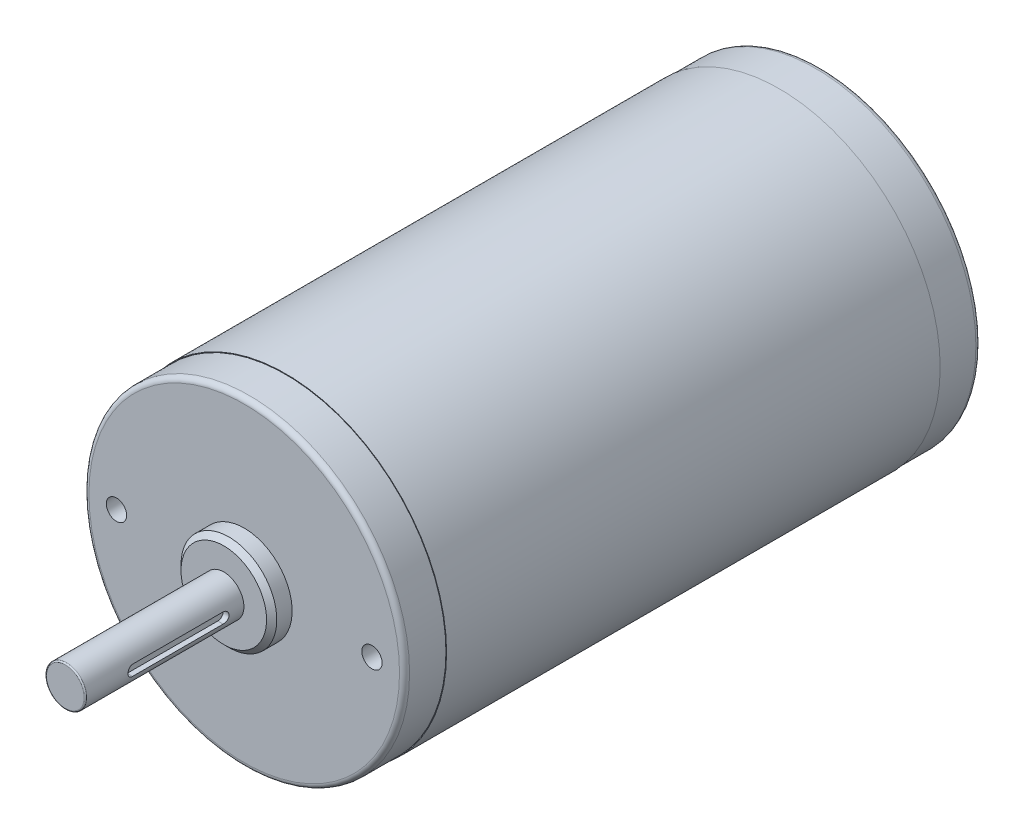
ISO-10303-21;
HEADER;
FILE_DESCRIPTION(('STEP AP214'),'2;1');
FILE_NAME('part.step','',(''),(''),'','','');
FILE_SCHEMA(('AUTOMOTIVE_DESIGN { 1 0 10303 214 1 1 1 1 }'));
ENDSEC;
DATA;
#1=APPLICATION_CONTEXT('core data for automotive mechanical design processes');
#2=APPLICATION_PROTOCOL_DEFINITION('international standard','automotive_design',2000,#1);
#3=PRODUCT_CONTEXT('',#1,'mechanical');
#4=PRODUCT('Part','Part','',(#3));
#5=PRODUCT_RELATED_PRODUCT_CATEGORY('part','',(#4));
#6=PRODUCT_DEFINITION_FORMATION('','',#4);
#7=PRODUCT_DEFINITION_CONTEXT('part definition',#1,'design');
#8=PRODUCT_DEFINITION('design','',#6,#7);
#9=PRODUCT_DEFINITION_SHAPE('','',#8);
#10=(LENGTH_UNIT() NAMED_UNIT(*) SI_UNIT(.MILLI.,.METRE.));
#11=(NAMED_UNIT(*) PLANE_ANGLE_UNIT() SI_UNIT($,.RADIAN.));
#12=(NAMED_UNIT(*) SI_UNIT($,.STERADIAN.) SOLID_ANGLE_UNIT());
#13=UNCERTAINTY_MEASURE_WITH_UNIT(LENGTH_MEASURE(1.E-05),#10,'distance_accuracy_value','');
#14=(GEOMETRIC_REPRESENTATION_CONTEXT(3) GLOBAL_UNCERTAINTY_ASSIGNED_CONTEXT((#13)) GLOBAL_UNIT_ASSIGNED_CONTEXT((#10,
#11,#12)) REPRESENTATION_CONTEXT('',''));
#15=CARTESIAN_POINT('',(0.,0.,0.));
#16=DIRECTION('',(0.,0.,1.));
#17=DIRECTION('',(1.,0.,0.));
#18=AXIS2_PLACEMENT_3D('',#15,#16,#17);
#19=CARTESIAN_POINT('',(35.56,109.2962,54.614));
#20=DIRECTION('',(0.,0.,1.));
#21=DIRECTION('',(1.,0.,0.));
#22=AXIS2_PLACEMENT_3D('',#19,#20,#21);
#23=PLANE('',#22);
#24=CARTESIAN_POINT('',(35.56,109.2962,54.614));
#25=DIRECTION('',(0.,0.,-1.));
#26=DIRECTION('',(-1.,0.,0.));
#27=AXIS2_PLACEMENT_3D('',#24,#25,#26);
#28=CIRCLE('',#27,3.74600000000008);
#29=CARTESIAN_POINT('',(31.8139999999999,109.2962,54.614));
#30=VERTEX_POINT('',#29);
#31=CARTESIAN_POINT('',(39.3060000000001,109.2962,54.614));
#32=VERTEX_POINT('',#31);
#33=EDGE_CURVE('E123',#30,#32,#28,.T.);
#34=ORIENTED_EDGE('',*,*,#33,.F.);
#35=CARTESIAN_POINT('',(35.56,109.2962,54.614));
#36=DIRECTION('',(0.,0.,-1.));
#37=DIRECTION('',(1.,0.,0.));
#38=AXIS2_PLACEMENT_3D('',#35,#36,#37);
#39=CIRCLE('',#38,3.74600000000008);
#40=EDGE_CURVE('E116',#32,#30,#39,.T.);
#41=ORIENTED_EDGE('',*,*,#40,.F.);
#42=EDGE_LOOP('',(#34,#41));
#43=FACE_BOUND('',#42,.T.);
#44=ADVANCED_FACE('F24',(#43),#23,.T.);
#45=CARTESIAN_POINT('',(38.3600000000001,109.2962,16.4984772078548));
#46=DIRECTION('',(1.,0.,0.));
#47=DIRECTION('',(0.,0.,-1.));
#48=AXIS2_PLACEMENT_3D('',#45,#46,#47);
#49=PLANE('',#48);
#50=DIRECTION('',(0.,0.,1.));
#51=VECTOR('',#50,1.);
#52=CARTESIAN_POINT('',(38.3600000000001,108.2462,16.4984772078548));
#53=LINE('',#52,#51);
#54=CARTESIAN_POINT('',(38.3600000000001,108.2462,27.1));
#55=VERTEX_POINT('',#54);
#56=CARTESIAN_POINT('',(38.3600000000001,108.2462,45.1));
#57=VERTEX_POINT('',#56);
#58=EDGE_CURVE('E111',#55,#57,#53,.T.);
#59=ORIENTED_EDGE('',*,*,#58,.F.);
#60=CARTESIAN_POINT('',(38.3600000000001,109.2962,27.1));
#61=DIRECTION('',(1.,0.,0.));
#62=DIRECTION('',(0.,0.,-1.));
#63=AXIS2_PLACEMENT_3D('',#60,#61,#62);
#64=CIRCLE('',#63,1.05);
#65=CARTESIAN_POINT('',(38.3600000000001,110.3462,27.1));
#66=VERTEX_POINT('',#65);
#67=EDGE_CURVE('E101',#55,#66,#64,.T.);
#68=ORIENTED_EDGE('',*,*,#67,.T.);
#69=DIRECTION('',(0.,0.,1.));
#70=VECTOR('',#69,1.);
#71=CARTESIAN_POINT('',(38.3600000000001,110.3462,16.4984772078548));
#72=LINE('',#71,#70);
#73=CARTESIAN_POINT('',(38.3600000000001,110.3462,45.1));
#74=VERTEX_POINT('',#73);
#75=EDGE_CURVE('E127',#66,#74,#72,.T.);
#76=ORIENTED_EDGE('',*,*,#75,.T.);
#77=CARTESIAN_POINT('',(38.3600000000001,109.2962,45.1));
#78=DIRECTION('',(-1.,0.,0.));
#79=DIRECTION('',(0.,0.,1.));
#80=AXIS2_PLACEMENT_3D('',#77,#78,#79);
#81=CIRCLE('',#80,1.05);
#82=EDGE_CURVE('E95',#74,#57,#81,.F.);
#83=ORIENTED_EDGE('',*,*,#82,.T.);
#84=EDGE_LOOP('',(#59,#68,#76,#83));
#85=FACE_BOUND('',#84,.T.);
#86=ADVANCED_FACE('F112',(#85),#49,.T.);
#87=CARTESIAN_POINT('',(38.3600000000001,108.2462,16.4984772078548));
#88=DIRECTION('',(0.,1.,0.));
#89=DIRECTION('',(0.,0.,1.));
#90=AXIS2_PLACEMENT_3D('',#87,#88,#89);
#91=PLANE('',#90);
#92=DIRECTION('',(0.,0.,-1.));
#93=VECTOR('',#92,1.);
#94=CARTESIAN_POINT('',(39.4197279696891,108.2462,54.614));
#95=LINE('',#94,#93);
#96=CARTESIAN_POINT('',(39.4197279696891,108.2462,27.1));
#97=VERTEX_POINT('',#96);
#98=CARTESIAN_POINT('',(39.4197279696891,108.2462,45.1));
#99=VERTEX_POINT('',#98);
#100=EDGE_CURVE('E120',#97,#99,#95,.F.);
#101=ORIENTED_EDGE('',*,*,#100,.F.);
#102=DIRECTION('',(1.,0.,0.));
#103=VECTOR('',#102,1.);
#104=CARTESIAN_POINT('',(38.3600000000001,108.2462,27.1));
#105=LINE('',#104,#103);
#106=EDGE_CURVE('E105',#97,#55,#105,.F.);
#107=ORIENTED_EDGE('',*,*,#106,.T.);
#108=ORIENTED_EDGE('',*,*,#58,.T.);
#109=DIRECTION('',(1.,0.,0.));
#110=VECTOR('',#109,1.);
#111=CARTESIAN_POINT('',(38.3600000000001,108.2462,45.1));
#112=LINE('',#111,#110);
#113=EDGE_CURVE('E121',#57,#99,#112,.T.);
#114=ORIENTED_EDGE('',*,*,#113,.T.);
#115=EDGE_LOOP('',(#101,#107,#108,#114));
#116=FACE_BOUND('',#115,.T.);
#117=ADVANCED_FACE('F118',(#116),#91,.T.);
#118=CARTESIAN_POINT('',(35.56,109.2962,54.36));
#119=DIRECTION('',(0.,0.,1.));
#120=DIRECTION('',(1.,0.,0.));
#121=AXIS2_PLACEMENT_3D('',#118,#119,#120);
#122=TOROIDAL_SURFACE('',#121,3.74600000000008,0.254);
#123=ORIENTED_EDGE('',*,*,#40,.T.);
#124=ORIENTED_EDGE('',*,*,#33,.T.);
#125=EDGE_LOOP('',(#123,#124));
#126=FACE_BOUND('',#125,.T.);
#127=CARTESIAN_POINT('',(35.56,109.2962,54.36));
#128=DIRECTION('',(0.,0.,-1.));
#129=DIRECTION('',(-1.,0.,0.));
#130=AXIS2_PLACEMENT_3D('',#127,#128,#129);
#131=CIRCLE('',#130,4.00000000000007);
#132=CARTESIAN_POINT('',(31.5599999999999,109.2962,54.36));
#133=VERTEX_POINT('',#132);
#134=EDGE_CURVE('E172',#133,#133,#131,.T.);
#135=ORIENTED_EDGE('',*,*,#134,.F.);
#136=EDGE_LOOP('',(#135));
#137=FACE_BOUND('',#136,.T.);
#138=ADVANCED_FACE('F154',(#126,#137),#122,.T.);
#139=CARTESIAN_POINT('',(38.3600000000001,109.2962,45.1));
#140=DIRECTION('',(-1.,0.,0.));
#141=DIRECTION('',(0.,0.,1.));
#142=AXIS2_PLACEMENT_3D('',#139,#140,#141);
#143=CYLINDRICAL_SURFACE('',#142,1.05);
#144=DIRECTION('',(1.,0.,0.));
#145=VECTOR('',#144,1.);
#146=CARTESIAN_POINT('',(38.3600000000001,110.3462,45.1));
#147=LINE('',#146,#145);
#148=CARTESIAN_POINT('',(39.4197279696891,110.3462,45.1));
#149=VERTEX_POINT('',#148);
#150=EDGE_CURVE('E109',#74,#149,#147,.T.);
#151=ORIENTED_EDGE('',*,*,#150,.T.);
#152=CARTESIAN_POINT('',(39.4197279696891,108.2462,45.1));
#153=CARTESIAN_POINT('',(39.4197258950768,108.24619958975,45.1289948990377));
#154=CARTESIAN_POINT('',(39.4200551064328,108.247401772744,45.1579753771942));
#155=CARTESIAN_POINT('',(39.4213547123988,108.252193790165,45.2157185717611));
#156=CARTESIAN_POINT('',(39.4223249908093,108.255783191888,45.2444813266804));
#157=CARTESIAN_POINT('',(39.4261578920524,108.270078067236,45.3300048839447));
#158=CARTESIAN_POINT('',(39.4299428342912,108.284310457697,45.3861763507014));
#159=CARTESIAN_POINT('',(39.4395286889104,108.321713164946,45.4952257963179));
#160=CARTESIAN_POINT('',(39.445329326456,108.344882263286,45.5481042230163));
#161=CARTESIAN_POINT('',(39.4582892232805,108.399469503916,45.6492511443793));
#162=CARTESIAN_POINT('',(39.4654488628844,108.430889956344,45.6975183428654));
#163=CARTESIAN_POINT('',(39.4805119710478,108.501890363002,45.7892077701155));
#164=CARTESIAN_POINT('',(39.4884281885094,108.541632256913,45.8325024671448));
#165=CARTESIAN_POINT('',(39.5040047400555,108.627813145963,45.9119068745175));
#166=CARTESIAN_POINT('',(39.5116649818293,108.67425452566,45.9480140156475));
#167=CARTESIAN_POINT('',(39.526010604883,108.773412379805,46.0125503896214));
#168=CARTESIAN_POINT('',(39.5326785635433,108.826216831296,46.040848518688));
#169=CARTESIAN_POINT('',(39.5441298010583,108.936002054238,46.0880888400132));
#170=CARTESIAN_POINT('',(39.5489153447307,108.992977708579,46.1070422822868));
#171=CARTESIAN_POINT('',(39.5549473168842,109.091228422711,46.1306241727345));
#172=CARTESIAN_POINT('',(39.5568321627736,109.13185376544,46.1378772746766));
#173=CARTESIAN_POINT('',(39.5593590428507,109.213713896391,46.147566034752));
#174=CARTESIAN_POINT('',(39.560001100914,109.254948672889,46.1500017854335));
#175=CARTESIAN_POINT('',(39.5599984549201,109.354094261643,46.1499974942296));
#176=CARTESIAN_POINT('',(39.5587300938834,109.412021122661,46.1451938276971));
#177=CARTESIAN_POINT('',(39.5537908073877,109.526225171743,46.1261319193829));
#178=CARTESIAN_POINT('',(39.5501176251492,109.582500758305,46.1118647965529));
#179=CARTESIAN_POINT('',(39.5407752151886,109.691711041936,46.0743710095572));
#180=CARTESIAN_POINT('',(39.5351088856793,109.744650458997,46.051157349786));
#181=CARTESIAN_POINT('',(39.5223803452478,109.845880148194,45.9964722913931));
#182=CARTESIAN_POINT('',(39.5153181479083,109.894170465564,45.9650009731229));
#183=CARTESIAN_POINT('',(39.5003832391547,109.985824414736,45.8939447079381));
#184=CARTESIAN_POINT('',(39.4924970081334,110.029068444468,45.8542083308329));
#185=CARTESIAN_POINT('',(39.4768899553604,110.108363690847,45.768070017791));
#186=CARTESIAN_POINT('',(39.4691691622905,110.144413669136,45.7216669366335));
#187=CARTESIAN_POINT('',(39.4546281048764,110.208880604601,45.6225587145474));
#188=CARTESIAN_POINT('',(39.447825217303,110.237158627992,45.5697605148942));
#189=CARTESIAN_POINT('',(39.4360941322255,110.284374941225,45.4599645484902));
#190=CARTESIAN_POINT('',(39.4311644713835,110.303320524877,45.4029701015121));
#191=CARTESIAN_POINT('',(39.424947536189,110.326869937927,45.3047298343336));
#192=CARTESIAN_POINT('',(39.4230031721686,110.334106552333,45.2641375466187));
#193=CARTESIAN_POINT('',(39.4203876966156,110.343775049367,45.1823710409093));
#194=CARTESIAN_POINT('',(39.419715789786,110.346209933161,45.141197202614));
#195=CARTESIAN_POINT('',(39.4197279696891,110.3462,45.1));
#196=B_SPLINE_CURVE_WITH_KNOTS('',3,(#152,#153,#154,#155,#156,#157,#158,#159,#160,#161,#162,
#163,#164,#165,#166,#167,#168,#169,#170,#171,#172,#173,#174,#175,#176,#177,#178,#179,#180,#181,
#182,#183,#184,#185,#186,#187,#188,#189,#190,#191,#192,#193,#194,#195),.UNSPECIFIED.,.F.,.F.,(4,
2,2,2,2,2,2,2,2,2,2,2,2,2,2,2,2,2,2,2,2,4),(0.,0.0869295778834422,0.17384340328612,
0.347151826879625,0.520436629596116,0.69376999881019,0.870856390838584,1.04800596970821,
1.22797015523126,1.40771715061754,1.53136439682193,1.65500926755904,1.82853892099362,
2.0022316554156,2.17567286221397,2.34911238140169,2.52606492372393,2.70304789975981,
2.88301467869373,3.0628405797152,3.18638852057382,3.3098592173462),.UNSPECIFIED.);
#197=EDGE_CURVE('E175',#99,#149,#196,.T.);
#198=ORIENTED_EDGE('',*,*,#197,.F.);
#199=ORIENTED_EDGE('',*,*,#113,.F.);
#200=ORIENTED_EDGE('',*,*,#82,.F.);
#201=EDGE_LOOP('',(#151,#198,#199,#200));
#202=FACE_BOUND('',#201,.T.);
#203=ADVANCED_FACE('F164',(#202),#143,.F.);
#204=CARTESIAN_POINT('',(38.3600000000001,110.3462,16.4984772078548));
#205=DIRECTION('',(0.,1.,0.));
#206=DIRECTION('',(0.,0.,1.));
#207=AXIS2_PLACEMENT_3D('',#204,#205,#206);
#208=PLANE('',#207);
#209=ORIENTED_EDGE('',*,*,#150,.F.);
#210=ORIENTED_EDGE('',*,*,#75,.F.);
#211=DIRECTION('',(1.,0.,0.));
#212=VECTOR('',#211,1.);
#213=CARTESIAN_POINT('',(38.3600000000001,110.3462,27.1));
#214=LINE('',#213,#212);
#215=CARTESIAN_POINT('',(39.4197279696891,110.3462,27.1));
#216=VERTEX_POINT('',#215);
#217=EDGE_CURVE('E107',#66,#216,#214,.T.);
#218=ORIENTED_EDGE('',*,*,#217,.T.);
#219=DIRECTION('',(0.,0.,-1.));
#220=VECTOR('',#219,1.);
#221=CARTESIAN_POINT('',(39.4197279696891,110.3462,54.614));
#222=LINE('',#221,#220);
#223=EDGE_CURVE('E177',#149,#216,#222,.T.);
#224=ORIENTED_EDGE('',*,*,#223,.F.);
#225=EDGE_LOOP('',(#209,#210,#218,#224));
#226=FACE_BOUND('',#225,.T.);
#227=ADVANCED_FACE('F423',(#226),#208,.F.);
#228=CARTESIAN_POINT('',(38.3600000000001,109.2962,27.1));
#229=DIRECTION('',(1.,0.,0.));
#230=DIRECTION('',(0.,0.,-1.));
#231=AXIS2_PLACEMENT_3D('',#228,#229,#230);
#232=CYLINDRICAL_SURFACE('',#231,1.05);
#233=ORIENTED_EDGE('',*,*,#67,.F.);
#234=ORIENTED_EDGE('',*,*,#106,.F.);
#235=CARTESIAN_POINT('',(39.4197279696891,110.3462,27.1));
#236=CARTESIAN_POINT('',(39.4197258950768,110.34620041025,27.0710051009623));
#237=CARTESIAN_POINT('',(39.4200551064329,110.344998227256,27.0420246228058));
#238=CARTESIAN_POINT('',(39.4213547123988,110.340206209835,26.9842814282389));
#239=CARTESIAN_POINT('',(39.4223249908093,110.336616808112,26.9555186733196));
#240=CARTESIAN_POINT('',(39.4261578920524,110.322321932764,26.8699951160553));
#241=CARTESIAN_POINT('',(39.4299428342912,110.308089542303,26.8138236492985));
#242=CARTESIAN_POINT('',(39.4395286889104,110.270686835054,26.7047742036821));
#243=CARTESIAN_POINT('',(39.445329326456,110.247517736714,26.6518957769836));
#244=CARTESIAN_POINT('',(39.4582892232805,110.192930496084,26.5507488556207));
#245=CARTESIAN_POINT('',(39.4654488628844,110.161510043656,26.5024816571346));
#246=CARTESIAN_POINT('',(39.4805119710478,110.090509636998,26.4107922298844));
#247=CARTESIAN_POINT('',(39.4884281885094,110.050767743087,26.3674975328551));
#248=CARTESIAN_POINT('',(39.5040047400555,109.964586854037,26.2880931254825));
#249=CARTESIAN_POINT('',(39.5116649818293,109.91814547434,26.2519859843525));
#250=CARTESIAN_POINT('',(39.526010604883,109.818987620195,26.1874496103786));
#251=CARTESIAN_POINT('',(39.5326785635433,109.766183168704,26.159151481312));
#252=CARTESIAN_POINT('',(39.5441298010583,109.656397945762,26.1119111599868));
#253=CARTESIAN_POINT('',(39.5489153447307,109.599422291421,26.0929577177131));
#254=CARTESIAN_POINT('',(39.5549473168842,109.501171577289,26.0693758272655));
#255=CARTESIAN_POINT('',(39.5568321627736,109.46054623456,26.0621227253234));
#256=CARTESIAN_POINT('',(39.5593590428507,109.378686103609,26.052433965248));
#257=CARTESIAN_POINT('',(39.560001100914,109.337451327111,26.0499982145665));
#258=CARTESIAN_POINT('',(39.5599984549201,109.238305738357,26.0500025057704));
#259=CARTESIAN_POINT('',(39.5587300938834,109.18037887734,26.0548061723029));
#260=CARTESIAN_POINT('',(39.5537908073877,109.066174828257,26.0738680806171));
#261=CARTESIAN_POINT('',(39.5501176251492,109.009899241695,26.0881352034471));
#262=CARTESIAN_POINT('',(39.5407752151886,108.900688958064,26.1256289904428));
#263=CARTESIAN_POINT('',(39.5351088856793,108.847749541003,26.148842650214));
#264=CARTESIAN_POINT('',(39.5223803452478,108.746519851806,26.2035277086069));
#265=CARTESIAN_POINT('',(39.5153181479083,108.698229534436,26.2349990268771));
#266=CARTESIAN_POINT('',(39.5003832391547,108.606575585264,26.3060552920619));
#267=CARTESIAN_POINT('',(39.4924970081334,108.563331555532,26.3457916691671));
#268=CARTESIAN_POINT('',(39.4768899553604,108.484036309153,26.431929982209));
#269=CARTESIAN_POINT('',(39.4691691622905,108.447986330864,26.4783330633665));
#270=CARTESIAN_POINT('',(39.4546281048764,108.383519395399,26.5774412854526));
#271=CARTESIAN_POINT('',(39.447825217303,108.355241372008,26.6302394851058));
#272=CARTESIAN_POINT('',(39.4360941322255,108.308025058775,26.7400354515098));
#273=CARTESIAN_POINT('',(39.4311644713835,108.289079475123,26.7970298984879));
#274=CARTESIAN_POINT('',(39.424947536189,108.265530062073,26.8952701656664));
#275=CARTESIAN_POINT('',(39.4230031721686,108.258293447667,26.9358624533813));
#276=CARTESIAN_POINT('',(39.4203876966156,108.248624950633,27.0176289590907));
#277=CARTESIAN_POINT('',(39.419715789786,108.246190066839,27.058802797386));
#278=CARTESIAN_POINT('',(39.4197279696891,108.2462,27.1));
#279=B_SPLINE_CURVE_WITH_KNOTS('',3,(#235,#236,#237,#238,#239,#240,#241,#242,#243,#244,#245,
#246,#247,#248,#249,#250,#251,#252,#253,#254,#255,#256,#257,#258,#259,#260,#261,#262,#263,#264,
#265,#266,#267,#268,#269,#270,#271,#272,#273,#274,#275,#276,#277,#278),.UNSPECIFIED.,.F.,.F.,(4,
2,2,2,2,2,2,2,2,2,2,2,2,2,2,2,2,2,2,2,2,4),(0.,0.0869295778834455,0.173843403286115,
0.347151826879623,0.520436629596136,0.693769998810197,0.870856390838592,1.0480059697082,
1.22797015523124,1.40771715061754,1.53136439682191,1.65500926755904,1.82853892099358,
2.00223165541559,2.17567286221396,2.34911238140168,2.52606492372391,2.7030478997598,
2.88301467869372,3.06284057971519,3.18638852057381,3.30985921734618),.UNSPECIFIED.);
#280=EDGE_CURVE('E180',#216,#97,#279,.T.);
#281=ORIENTED_EDGE('',*,*,#280,.F.);
#282=ORIENTED_EDGE('',*,*,#217,.F.);
#283=EDGE_LOOP('',(#233,#234,#281,#282));
#284=FACE_BOUND('',#283,.T.);
#285=ADVANCED_FACE('F102',(#284),#232,.F.);
#286=CARTESIAN_POINT('',(35.56,109.2962,54.614));
#287=DIRECTION('',(0.,0.,-1.));
#288=DIRECTION('',(-1.,0.,0.));
#289=AXIS2_PLACEMENT_3D('',#286,#287,#288);
#290=CYLINDRICAL_SURFACE('',#289,4.00000000000007);
#291=ORIENTED_EDGE('',*,*,#100,.T.);
#292=ORIENTED_EDGE('',*,*,#197,.T.);
#293=ORIENTED_EDGE('',*,*,#223,.T.);
#294=ORIENTED_EDGE('',*,*,#280,.T.);
#295=EDGE_LOOP('',(#291,#292,#293,#294));
#296=FACE_BOUND('',#295,.T.);
#297=CARTESIAN_POINT('',(35.56,109.2962,23.114));
#298=DIRECTION('',(0.,0.,-1.));
#299=DIRECTION('',(-1.,0.,0.));
#300=AXIS2_PLACEMENT_3D('',#297,#298,#299);
#301=CIRCLE('',#300,4.00000000000007);
#302=CARTESIAN_POINT('',(31.5599999999999,109.2962,23.114));
#303=VERTEX_POINT('',#302);
#304=EDGE_CURVE('E416',#303,#303,#301,.T.);
#305=ORIENTED_EDGE('',*,*,#304,.F.);
#306=EDGE_LOOP('',(#305));
#307=FACE_BOUND('',#306,.T.);
#308=ORIENTED_EDGE('',*,*,#134,.T.);
#309=EDGE_LOOP('',(#308));
#310=FACE_BOUND('',#309,.T.);
#311=ADVANCED_FACE('F263',(#296,#307,#310),#290,.T.);
#312=CARTESIAN_POINT('',(35.56,109.2962,23.114));
#313=DIRECTION('',(0.,0.,1.));
#314=DIRECTION('',(1.,0.,0.));
#315=AXIS2_PLACEMENT_3D('',#312,#313,#314);
#316=PLANE('',#315);
#317=ORIENTED_EDGE('',*,*,#304,.T.);
#318=EDGE_LOOP('',(#317));
#319=FACE_BOUND('',#318,.T.);
#320=CARTESIAN_POINT('',(35.56,109.2962,23.114));
#321=DIRECTION('',(0.,0.,-1.));
#322=DIRECTION('',(-1.,0.,0.));
#323=AXIS2_PLACEMENT_3D('',#320,#321,#322);
#324=CIRCLE('',#323,8.50900000182337);
#325=CARTESIAN_POINT('',(27.0509999981766,109.2962,23.114));
#326=VERTEX_POINT('',#325);
#327=EDGE_CURVE('E414',#326,#326,#324,.T.);
#328=ORIENTED_EDGE('',*,*,#327,.F.);
#329=EDGE_LOOP('',(#328));
#330=FACE_BOUND('',#329,.T.);
#331=ADVANCED_FACE('F259',(#319,#330),#316,.T.);
#332=CARTESIAN_POINT('',(48.8853596371201,127.903290682857,-97.8026999980236));
#333=DIRECTION('',(0.,0.,-1.));
#334=DIRECTION('',(-1.,0.,0.));
#335=AXIS2_PLACEMENT_3D('',#332,#333,#334);
#336=PLANE('',#335);
#337=CARTESIAN_POINT('',(46.76735963712,127.903290682857,-97.8026999979988));
#338=DIRECTION('',(0.,0.,1.));
#339=DIRECTION('',(0.,-1.,0.));
#340=AXIS2_PLACEMENT_3D('',#337,#338,#339);
#341=CIRCLE('',#340,2.11800000003411);
#342=CARTESIAN_POINT('',(46.76735963712,125.785290682823,-97.8026999979988));
#343=VERTEX_POINT('',#342);
#344=EDGE_CURVE('E411',#343,#343,#341,.T.);
#345=ORIENTED_EDGE('',*,*,#344,.F.);
#346=EDGE_LOOP('',(#345));
#347=FACE_BOUND('',#346,.T.);
#348=ADVANCED_FACE('F255',(#347),#336,.T.);
#349=CARTESIAN_POINT('',(56.2850906808811,120.503559639096,-97.8026999980238));
#350=DIRECTION('',(0.,0.,-1.));
#351=DIRECTION('',(-1.,0.,0.));
#352=AXIS2_PLACEMENT_3D('',#349,#350,#351);
#353=PLANE('',#352);
#354=CARTESIAN_POINT('',(54.1670906808811,120.503559639096,-97.8026999980557));
#355=DIRECTION('',(0.,0.,1.));
#356=DIRECTION('',(0.,-1.,0.));
#357=AXIS2_PLACEMENT_3D('',#354,#355,#356);
#358=CIRCLE('',#357,2.11799999994966);
#359=CARTESIAN_POINT('',(54.1670906808811,118.385559639146,-97.8026999980557));
#360=VERTEX_POINT('',#359);
#361=EDGE_CURVE('E407',#360,#360,#358,.T.);
#362=ORIENTED_EDGE('',*,*,#361,.F.);
#363=EDGE_LOOP('',(#362));
#364=FACE_BOUND('',#363,.T.);
#365=ADVANCED_FACE('F243',(#364),#353,.T.);
#366=CARTESIAN_POINT('',(35.56,109.2962,-100.317299999998));
#367=DIRECTION('',(0.,0.,-1.));
#368=DIRECTION('',(-1.,0.,0.));
#369=AXIS2_PLACEMENT_3D('',#366,#367,#368);
#370=PLANE('',#369);
#371=CARTESIAN_POINT('',(35.56,109.2962,-100.317299999998));
#372=DIRECTION('',(0.,0.,1.));
#373=DIRECTION('',(1.,0.,0.));
#374=AXIS2_PLACEMENT_3D('',#371,#372,#373);
#375=CIRCLE('',#374,14.0368000000003);
#376=CARTESIAN_POINT('',(49.5968000000003,109.2962,-100.317299999998));
#377=VERTEX_POINT('',#376);
#378=CARTESIAN_POINT('',(21.5231999999997,109.2962,-100.317299999998));
#379=VERTEX_POINT('',#378);
#380=EDGE_CURVE('E224',#377,#379,#375,.T.);
#381=ORIENTED_EDGE('',*,*,#380,.F.);
#382=CARTESIAN_POINT('',(35.56,109.2962,-100.317299999998));
#383=DIRECTION('',(0.,0.,1.));
#384=DIRECTION('',(-1.,0.,0.));
#385=AXIS2_PLACEMENT_3D('',#382,#383,#384);
#386=CIRCLE('',#385,14.0368000000003);
#387=EDGE_CURVE('E410',#379,#377,#386,.T.);
#388=ORIENTED_EDGE('',*,*,#387,.F.);
#389=EDGE_LOOP('',(#381,#388));
#390=FACE_BOUND('',#389,.T.);
#391=ADVANCED_FACE('F232',(#390),#370,.T.);
#392=CARTESIAN_POINT('',(10.1599999999994,109.2962,5.43560000011212));
#393=DIRECTION('',(0.,0.,1.));
#394=DIRECTION('',(1.,0.,0.));
#395=AXIS2_PLACEMENT_3D('',#392,#393,#394);
#396=CONICAL_SURFACE('',#395,2.01930000012817,1.02974425747654);
#397=CARTESIAN_POINT('',(10.1600000000133,109.2962,4.22228214875986));
#398=VERTEX_POINT('',#397);
#399=VERTEX_LOOP('',#398);
#400=FACE_BOUND('',#399,.T.);
#401=CARTESIAN_POINT('',(10.1599999999994,109.2962,5.4356000000007));
#402=DIRECTION('',(0.,0.,1.));
#403=DIRECTION('',(1.,0.,0.));
#404=AXIS2_PLACEMENT_3D('',#401,#402,#403);
#405=CIRCLE('',#404,2.01930000000003);
#406=CARTESIAN_POINT('',(12.1792999999994,109.2962,5.4356000000007));
#407=VERTEX_POINT('',#406);
#408=EDGE_CURVE('E221',#407,#407,#405,.T.);
#409=ORIENTED_EDGE('',*,*,#408,.T.);
#410=EDGE_LOOP('',(#409));
#411=FACE_BOUND('',#410,.T.);
#412=ADVANCED_FACE('F242',(#400,#411),#396,.F.);
#413=CARTESIAN_POINT('',(60.96,109.2962,5.43559999994159));
#414=DIRECTION('',(0.,0.,1.));
#415=DIRECTION('',(1.,0.,0.));
#416=AXIS2_PLACEMENT_3D('',#413,#414,#415);
#417=CONICAL_SURFACE('',#416,2.01929999988128,1.02974425744088);
#418=CARTESIAN_POINT('',(60.9599999998807,109.2962,4.22228214875986));
#419=VERTEX_POINT('',#418);
#420=VERTEX_LOOP('',#419);
#421=FACE_BOUND('',#420,.T.);
#422=CARTESIAN_POINT('',(60.96,109.2962,5.43560000000074));
#423=DIRECTION('',(0.,0.,1.));
#424=DIRECTION('',(1.,0.,0.));
#425=AXIS2_PLACEMENT_3D('',#422,#423,#424);
#426=CIRCLE('',#425,2.01930000000003);
#427=CARTESIAN_POINT('',(62.9793,109.2962,5.43560000000074));
#428=VERTEX_POINT('',#427);
#429=EDGE_CURVE('E218',#428,#428,#426,.T.);
#430=ORIENTED_EDGE('',*,*,#429,.T.);
#431=EDGE_LOOP('',(#430));
#432=FACE_BOUND('',#431,.T.);
#433=ADVANCED_FACE('F627',(#421,#432),#417,.F.);
#434=CARTESIAN_POINT('',(35.56,109.2962,22.0979999999996));
#435=DIRECTION('',(0.,0.,-1.));
#436=DIRECTION('',(-1.,0.,0.));
#437=AXIS2_PLACEMENT_3D('',#434,#435,#436);
#438=CONICAL_SURFACE('',#437,9.52500000000019,0.785398162500005);
#439=CARTESIAN_POINT('',(35.56,109.2962,22.0979999999996));
#440=DIRECTION('',(0.,0.,-1.));
#441=DIRECTION('',(-1.,0.,0.));
#442=AXIS2_PLACEMENT_3D('',#439,#440,#441);
#443=CIRCLE('',#442,9.52500000000019);
#444=CARTESIAN_POINT('',(26.0349999999998,109.2962,22.0979999999996));
#445=VERTEX_POINT('',#444);
#446=EDGE_CURVE('E215',#445,#445,#443,.T.);
#447=ORIENTED_EDGE('',*,*,#446,.F.);
#448=EDGE_LOOP('',(#447));
#449=FACE_BOUND('',#448,.T.);
#450=ORIENTED_EDGE('',*,*,#327,.T.);
#451=EDGE_LOOP('',(#450));
#452=FACE_BOUND('',#451,.T.);
#453=ADVANCED_FACE('F618',(#449,#452),#438,.T.);
#454=CARTESIAN_POINT('',(46.76735963712,127.903290682857,-95.6026999959931));
#455=DIRECTION('',(0.,0.,1.));
#456=DIRECTION('',(0.,-1.,0.));
#457=AXIS2_PLACEMENT_3D('',#454,#455,#456);
#458=CONICAL_SURFACE('',#457,4.31800000198298,0.785398163384529);
#459=CARTESIAN_POINT('',(46.76735963712,127.903290682857,-95.6026999960491));
#460=DIRECTION('',(0.,0.,1.));
#461=DIRECTION('',(1.,0.,0.));
#462=AXIS2_PLACEMENT_3D('',#459,#460,#461);
#463=CIRCLE('',#462,4.3180000019745);
#464=CARTESIAN_POINT('',(51.0853596390945,127.903290682857,-95.6026999960491));
#465=VERTEX_POINT('',#464);
#466=EDGE_CURVE('E212',#465,#465,#463,.T.);
#467=ORIENTED_EDGE('',*,*,#466,.F.);
#468=EDGE_LOOP('',(#467));
#469=FACE_BOUND('',#468,.T.);
#470=ORIENTED_EDGE('',*,*,#344,.T.);
#471=EDGE_LOOP('',(#470));
#472=FACE_BOUND('',#471,.T.);
#473=ADVANCED_FACE('F609',(#469,#472),#458,.T.);
#474=CARTESIAN_POINT('',(54.1670906808811,120.503559639096,-95.6026999961637));
#475=DIRECTION('',(0.,0.,1.));
#476=DIRECTION('',(0.,-1.,0.));
#477=AXIS2_PLACEMENT_3D('',#474,#475,#476);
#478=CONICAL_SURFACE('',#477,4.31800000184168,0.785398163397448);
#479=CARTESIAN_POINT('',(54.1670906808811,120.503559639096,-95.6026999960494));
#480=DIRECTION('',(0.,0.,1.));
#481=DIRECTION('',(1.,0.,0.));
#482=AXIS2_PLACEMENT_3D('',#479,#480,#481);
#483=CIRCLE('',#482,4.31800000197446);
#484=CARTESIAN_POINT('',(58.4850906828556,120.503559639096,-95.6026999960494));
#485=VERTEX_POINT('',#484);
#486=EDGE_CURVE('E209',#485,#485,#483,.T.);
#487=ORIENTED_EDGE('',*,*,#486,.F.);
#488=EDGE_LOOP('',(#487));
#489=FACE_BOUND('',#488,.T.);
#490=ORIENTED_EDGE('',*,*,#361,.T.);
#491=EDGE_LOOP('',(#490));
#492=FACE_BOUND('',#491,.T.);
#493=ADVANCED_FACE('F199',(#489,#492),#478,.T.);
#494=CARTESIAN_POINT('',(35.56,109.2962,-99.317299999998));
#495=DIRECTION('',(0.,0.,-1.));
#496=DIRECTION('',(-1.,0.,0.));
#497=AXIS2_PLACEMENT_3D('',#494,#495,#496);
#498=TOROIDAL_SURFACE('',#497,14.0368000000003,1.);
#499=ORIENTED_EDGE('',*,*,#387,.T.);
#500=ORIENTED_EDGE('',*,*,#380,.T.);
#501=EDGE_LOOP('',(#499,#500));
#502=FACE_BOUND('',#501,.T.);
#503=CARTESIAN_POINT('',(35.56,109.2962,-99.317299999998));
#504=DIRECTION('',(0.,0.,1.));
#505=DIRECTION('',(1.,0.,0.));
#506=AXIS2_PLACEMENT_3D('',#503,#504,#505);
#507=CIRCLE('',#506,15.0368000000003);
#508=CARTESIAN_POINT('',(50.5968000000003,109.2962,-99.317299999998));
#509=VERTEX_POINT('',#508);
#510=EDGE_CURVE('E207',#509,#509,#507,.T.);
#511=ORIENTED_EDGE('',*,*,#510,.F.);
#512=EDGE_LOOP('',(#511));
#513=FACE_BOUND('',#512,.T.);
#514=ADVANCED_FACE('F187',(#502,#513),#498,.T.);
#515=CARTESIAN_POINT('',(10.1599999999994,109.2962,19.05));
#516=DIRECTION('',(0.,0.,1.));
#517=DIRECTION('',(1.,0.,0.));
#518=AXIS2_PLACEMENT_3D('',#515,#516,#517);
#519=CYLINDRICAL_SURFACE('',#518,2.01930000000003);
#520=CARTESIAN_POINT('',(10.1599999999994,109.2962,19.05));
#521=DIRECTION('',(0.,0.,1.));
#522=DIRECTION('',(1.,0.,0.));
#523=AXIS2_PLACEMENT_3D('',#520,#521,#522);
#524=CIRCLE('',#523,2.01930000000003);
#525=CARTESIAN_POINT('',(12.1792999999994,109.2962,19.05));
#526=VERTEX_POINT('',#525);
#527=EDGE_CURVE('E404',#526,#526,#524,.F.);
#528=ORIENTED_EDGE('',*,*,#527,.F.);
#529=EDGE_LOOP('',(#528));
#530=FACE_BOUND('',#529,.T.);
#531=ORIENTED_EDGE('',*,*,#408,.F.);
#532=EDGE_LOOP('',(#531));
#533=FACE_BOUND('',#532,.T.);
#534=ADVANCED_FACE('F198',(#530,#533),#519,.F.);
#535=CARTESIAN_POINT('',(60.96,109.2962,19.05));
#536=DIRECTION('',(0.,0.,1.));
#537=DIRECTION('',(1.,0.,0.));
#538=AXIS2_PLACEMENT_3D('',#535,#536,#537);
#539=CYLINDRICAL_SURFACE('',#538,2.01930000000003);
#540=CARTESIAN_POINT('',(60.96,109.2962,19.05));
#541=DIRECTION('',(0.,0.,1.));
#542=DIRECTION('',(1.,0.,0.));
#543=AXIS2_PLACEMENT_3D('',#540,#541,#542);
#544=CIRCLE('',#543,2.01930000000003);
#545=CARTESIAN_POINT('',(62.9793,109.2962,19.05));
#546=VERTEX_POINT('',#545);
#547=EDGE_CURVE('E401',#546,#546,#544,.F.);
#548=ORIENTED_EDGE('',*,*,#547,.F.);
#549=EDGE_LOOP('',(#548));
#550=FACE_BOUND('',#549,.T.);
#551=ORIENTED_EDGE('',*,*,#429,.F.);
#552=EDGE_LOOP('',(#551));
#553=FACE_BOUND('',#552,.T.);
#554=ADVANCED_FACE('F578',(#550,#553),#539,.F.);
#555=CARTESIAN_POINT('',(35.56,109.2962,23.114));
#556=DIRECTION('',(0.,0.,-1.));
#557=DIRECTION('',(-1.,0.,0.));
#558=AXIS2_PLACEMENT_3D('',#555,#556,#557);
#559=CYLINDRICAL_SURFACE('',#558,9.52500000000019);
#560=CARTESIAN_POINT('',(35.56,109.2962,19.05));
#561=DIRECTION('',(0.,0.,-1.));
#562=DIRECTION('',(-1.,0.,0.));
#563=AXIS2_PLACEMENT_3D('',#560,#561,#562);
#564=CIRCLE('',#563,9.52500000000019);
#565=CARTESIAN_POINT('',(26.0349999999998,109.2962,19.05));
#566=VERTEX_POINT('',#565);
#567=EDGE_CURVE('E398',#566,#566,#564,.T.);
#568=ORIENTED_EDGE('',*,*,#567,.F.);
#569=EDGE_LOOP('',(#568));
#570=FACE_BOUND('',#569,.T.);
#571=ORIENTED_EDGE('',*,*,#446,.T.);
#572=EDGE_LOOP('',(#571));
#573=FACE_BOUND('',#572,.T.);
#574=ADVANCED_FACE('F569',(#570,#573),#559,.T.);
#575=CARTESIAN_POINT('',(46.76735963712,127.903290682857,-97.8026999980236));
#576=DIRECTION('',(0.,0.,1.));
#577=DIRECTION('',(1.,0.,0.));
#578=AXIS2_PLACEMENT_3D('',#575,#576,#577);
#579=CYLINDRICAL_SURFACE('',#578,4.3180000019745);
#580=CARTESIAN_POINT('',(46.76735963712,127.903290682857,-95.554799999998));
#581=DIRECTION('',(0.,0.,1.));
#582=DIRECTION('',(1.,0.,0.));
#583=AXIS2_PLACEMENT_3D('',#580,#581,#582);
#584=CIRCLE('',#583,4.3180000019745);
#585=CARTESIAN_POINT('',(51.0853596390945,127.903290682857,-95.554799999998));
#586=VERTEX_POINT('',#585);
#587=EDGE_CURVE('E390',#586,#586,#584,.T.);
#588=ORIENTED_EDGE('',*,*,#587,.F.);
#589=EDGE_LOOP('',(#588));
#590=FACE_BOUND('',#589,.T.);
#591=ORIENTED_EDGE('',*,*,#466,.T.);
#592=EDGE_LOOP('',(#591));
#593=FACE_BOUND('',#592,.T.);
#594=ADVANCED_FACE('F560',(#590,#593),#579,.T.);
#595=CARTESIAN_POINT('',(54.1670906808811,120.503559639096,-97.8026999980238));
#596=DIRECTION('',(0.,0.,1.));
#597=DIRECTION('',(1.,0.,0.));
#598=AXIS2_PLACEMENT_3D('',#595,#596,#597);
#599=CYLINDRICAL_SURFACE('',#598,4.31800000197446);
#600=CARTESIAN_POINT('',(54.1670906808811,120.503559639096,-95.554799999998));
#601=DIRECTION('',(0.,0.,1.));
#602=DIRECTION('',(1.,0.,0.));
#603=AXIS2_PLACEMENT_3D('',#600,#601,#602);
#604=CIRCLE('',#603,4.31800000197446);
#605=CARTESIAN_POINT('',(58.4850906828556,120.503559639096,-95.554799999998));
#606=VERTEX_POINT('',#605);
#607=EDGE_CURVE('E386',#606,#606,#604,.T.);
#608=ORIENTED_EDGE('',*,*,#607,.F.);
#609=EDGE_LOOP('',(#608));
#610=FACE_BOUND('',#609,.T.);
#611=ORIENTED_EDGE('',*,*,#486,.T.);
#612=EDGE_LOOP('',(#611));
#613=FACE_BOUND('',#612,.T.);
#614=ADVANCED_FACE('F550',(#610,#613),#599,.T.);
#615=CARTESIAN_POINT('',(35.56,109.2962,-100.317299999998));
#616=DIRECTION('',(0.,0.,1.));
#617=DIRECTION('',(1.,0.,0.));
#618=AXIS2_PLACEMENT_3D('',#615,#616,#617);
#619=CYLINDRICAL_SURFACE('',#618,15.0368000000003);
#620=CARTESIAN_POINT('',(35.56,109.2962,-95.554799999998));
#621=DIRECTION('',(0.,0.,1.));
#622=DIRECTION('',(1.,0.,0.));
#623=AXIS2_PLACEMENT_3D('',#620,#621,#622);
#624=CIRCLE('',#623,15.0368000000003);
#625=CARTESIAN_POINT('',(50.5968000000003,109.2962,-95.554799999998));
#626=VERTEX_POINT('',#625);
#627=EDGE_CURVE('E384',#626,#626,#624,.T.);
#628=ORIENTED_EDGE('',*,*,#627,.F.);
#629=EDGE_LOOP('',(#628));
#630=FACE_BOUND('',#629,.T.);
#631=ORIENTED_EDGE('',*,*,#510,.T.);
#632=EDGE_LOOP('',(#631));
#633=FACE_BOUND('',#632,.T.);
#634=ADVANCED_FACE('F541',(#630,#633),#619,.T.);
#635=CARTESIAN_POINT('',(35.56,109.2962,19.05));
#636=DIRECTION('',(0.,0.,1.));
#637=DIRECTION('',(1.,0.,0.));
#638=AXIS2_PLACEMENT_3D('',#635,#636,#637);
#639=PLANE('',#638);
#640=ORIENTED_EDGE('',*,*,#567,.T.);
#641=EDGE_LOOP('',(#640));
#642=FACE_BOUND('',#641,.T.);
#643=ORIENTED_EDGE('',*,*,#547,.T.);
#644=EDGE_LOOP('',(#643));
#645=FACE_BOUND('',#644,.T.);
#646=ORIENTED_EDGE('',*,*,#527,.T.);
#647=EDGE_LOOP('',(#646));
#648=FACE_BOUND('',#647,.T.);
#649=CARTESIAN_POINT('',(35.56,109.2962,19.05));
#650=DIRECTION('',(0.,0.,-1.));
#651=DIRECTION('',(-1.,0.,0.));
#652=AXIS2_PLACEMENT_3D('',#649,#650,#651);
#653=CIRCLE('',#652,30.8770000000005);
#654=CARTESIAN_POINT('',(4.6829999999995,109.2962,19.05));
#655=VERTEX_POINT('',#654);
#656=CARTESIAN_POINT('',(66.4370000000005,109.2962,19.05));
#657=VERTEX_POINT('',#656);
#658=EDGE_CURVE('E356',#655,#657,#653,.T.);
#659=ORIENTED_EDGE('',*,*,#658,.F.);
#660=CARTESIAN_POINT('',(35.56,109.2962,19.05));
#661=DIRECTION('',(0.,0.,-1.));
#662=DIRECTION('',(1.,0.,0.));
#663=AXIS2_PLACEMENT_3D('',#660,#661,#662);
#664=CIRCLE('',#663,30.8770000000005);
#665=EDGE_CURVE('E366',#657,#655,#664,.T.);
#666=ORIENTED_EDGE('',*,*,#665,.F.);
#667=EDGE_LOOP('',(#659,#666));
#668=FACE_BOUND('',#667,.T.);
#669=ADVANCED_FACE('F331',(#642,#645,#648,#668),#639,.T.);
#670=CARTESIAN_POINT('',(35.56,109.2962,-95.554799999998));
#671=DIRECTION('',(0.,0.,-1.));
#672=DIRECTION('',(-1.,0.,0.));
#673=AXIS2_PLACEMENT_3D('',#670,#671,#672);
#674=PLANE('',#673);
#675=ORIENTED_EDGE('',*,*,#627,.T.);
#676=EDGE_LOOP('',(#675));
#677=FACE_BOUND('',#676,.T.);
#678=ORIENTED_EDGE('',*,*,#607,.T.);
#679=EDGE_LOOP('',(#678));
#680=FACE_BOUND('',#679,.T.);
#681=ORIENTED_EDGE('',*,*,#587,.T.);
#682=EDGE_LOOP('',(#681));
#683=FACE_BOUND('',#682,.T.);
#684=CARTESIAN_POINT('',(35.56,109.2962,-95.554799999998));
#685=DIRECTION('',(0.,0.,1.));
#686=DIRECTION('',(1.,0.,0.));
#687=AXIS2_PLACEMENT_3D('',#684,#685,#686);
#688=CIRCLE('',#687,30.8770000000005);
#689=CARTESIAN_POINT('',(66.4370000000005,109.2962,-95.554799999998));
#690=VERTEX_POINT('',#689);
#691=CARTESIAN_POINT('',(4.6829999999995,109.2962,-95.554799999998));
#692=VERTEX_POINT('',#691);
#693=EDGE_CURVE('E315',#690,#692,#688,.T.);
#694=ORIENTED_EDGE('',*,*,#693,.F.);
#695=CARTESIAN_POINT('',(35.56,109.2962,-95.554799999998));
#696=DIRECTION('',(0.,0.,1.));
#697=DIRECTION('',(-1.,0.,0.));
#698=AXIS2_PLACEMENT_3D('',#695,#696,#697);
#699=CIRCLE('',#698,30.8770000000005);
#700=EDGE_CURVE('E44',#692,#690,#699,.T.);
#701=ORIENTED_EDGE('',*,*,#700,.F.);
#702=EDGE_LOOP('',(#694,#701));
#703=FACE_BOUND('',#702,.T.);
#704=ADVANCED_FACE('F322',(#677,#680,#683,#703),#674,.T.);
#705=CARTESIAN_POINT('',(35.56,109.2962,18.05));
#706=DIRECTION('',(0.,0.,1.));
#707=DIRECTION('',(1.,0.,0.));
#708=AXIS2_PLACEMENT_3D('',#705,#706,#707);
#709=TOROIDAL_SURFACE('',#708,30.8770000000005,1.);
#710=ORIENTED_EDGE('',*,*,#665,.T.);
#711=ORIENTED_EDGE('',*,*,#658,.T.);
#712=EDGE_LOOP('',(#710,#711));
#713=FACE_BOUND('',#712,.T.);
#714=CARTESIAN_POINT('',(35.56,109.2962,18.05));
#715=DIRECTION('',(0.,0.,-1.));
#716=DIRECTION('',(-1.,0.,0.));
#717=AXIS2_PLACEMENT_3D('',#714,#715,#716);
#718=CIRCLE('',#717,31.8770000000005);
#719=CARTESIAN_POINT('',(3.6829999999995,109.2962,18.05));
#720=VERTEX_POINT('',#719);
#721=EDGE_CURVE('E313',#720,#720,#718,.T.);
#722=ORIENTED_EDGE('',*,*,#721,.F.);
#723=EDGE_LOOP('',(#722));
#724=FACE_BOUND('',#723,.T.);
#725=ADVANCED_FACE('F302',(#713,#724),#709,.T.);
#726=CARTESIAN_POINT('',(35.56,109.2962,-94.554799999998));
#727=DIRECTION('',(0.,0.,-1.));
#728=DIRECTION('',(-1.,0.,0.));
#729=AXIS2_PLACEMENT_3D('',#726,#727,#728);
#730=TOROIDAL_SURFACE('',#729,30.8770000000005,1.);
#731=ORIENTED_EDGE('',*,*,#700,.T.);
#732=ORIENTED_EDGE('',*,*,#693,.T.);
#733=EDGE_LOOP('',(#731,#732));
#734=FACE_BOUND('',#733,.T.);
#735=CARTESIAN_POINT('',(35.56,109.2962,-94.554799999998));
#736=DIRECTION('',(0.,0.,1.));
#737=DIRECTION('',(1.,0.,0.));
#738=AXIS2_PLACEMENT_3D('',#735,#736,#737);
#739=CIRCLE('',#738,31.8770000000005);
#740=CARTESIAN_POINT('',(67.4370000000005,109.2962,-94.554799999998));
#741=VERTEX_POINT('',#740);
#742=EDGE_CURVE('E312',#741,#741,#739,.T.);
#743=ORIENTED_EDGE('',*,*,#742,.F.);
#744=EDGE_LOOP('',(#743));
#745=FACE_BOUND('',#744,.T.);
#746=ADVANCED_FACE('F290',(#734,#745),#730,.T.);
#747=CARTESIAN_POINT('',(35.56,109.2962,19.05));
#748=DIRECTION('',(0.,0.,-1.));
#749=DIRECTION('',(-1.,0.,0.));
#750=AXIS2_PLACEMENT_3D('',#747,#748,#749);
#751=CYLINDRICAL_SURFACE('',#750,31.8770000000005);
#752=CARTESIAN_POINT('',(35.56,109.2962,10.8204000000007));
#753=DIRECTION('',(0.,0.,-1.));
#754=DIRECTION('',(-1.,0.,0.));
#755=AXIS2_PLACEMENT_3D('',#752,#753,#754);
#756=CIRCLE('',#755,31.8770000000005);
#757=CARTESIAN_POINT('',(3.6829999999995,109.2962,10.8204000000007));
#758=VERTEX_POINT('',#757);
#759=EDGE_CURVE('E393',#758,#758,#756,.T.);
#760=ORIENTED_EDGE('',*,*,#759,.F.);
#761=EDGE_LOOP('',(#760));
#762=FACE_BOUND('',#761,.T.);
#763=ORIENTED_EDGE('',*,*,#721,.T.);
#764=EDGE_LOOP('',(#763));
#765=FACE_BOUND('',#764,.T.);
#766=ADVANCED_FACE('F301',(#762,#765),#751,.T.);
#767=CARTESIAN_POINT('',(35.56,109.2962,-95.554799999998));
#768=DIRECTION('',(0.,0.,1.));
#769=DIRECTION('',(1.,0.,0.));
#770=AXIS2_PLACEMENT_3D('',#767,#768,#769);
#771=CYLINDRICAL_SURFACE('',#770,31.8770000000005);
#772=CARTESIAN_POINT('',(35.56,109.2962,-87.325199999998));
#773=DIRECTION('',(0.,0.,1.));
#774=DIRECTION('',(1.,0.,0.));
#775=AXIS2_PLACEMENT_3D('',#772,#773,#774);
#776=CIRCLE('',#775,31.8770000000005);
#777=CARTESIAN_POINT('',(67.4370000000005,109.2962,-87.325199999998));
#778=VERTEX_POINT('',#777);
#779=EDGE_CURVE('E455',#778,#778,#776,.T.);
#780=ORIENTED_EDGE('',*,*,#779,.F.);
#781=EDGE_LOOP('',(#780));
#782=FACE_BOUND('',#781,.T.);
#783=ORIENTED_EDGE('',*,*,#742,.T.);
#784=EDGE_LOOP('',(#783));
#785=FACE_BOUND('',#784,.T.);
#786=ADVANCED_FACE('F444',(#782,#785),#771,.T.);
#787=CARTESIAN_POINT('',(67.5640000000005,109.2962,10.8204000000007));
#788=DIRECTION('',(0.,0.,1.));
#789=DIRECTION('',(1.,0.,0.));
#790=AXIS2_PLACEMENT_3D('',#787,#788,#789);
#791=PLANE('',#790);
#792=ORIENTED_EDGE('',*,*,#759,.T.);
#793=EDGE_LOOP('',(#792));
#794=FACE_BOUND('',#793,.T.);
#795=CARTESIAN_POINT('',(35.56,109.2962,10.8204000000007));
#796=DIRECTION('',(0.,0.,-1.));
#797=DIRECTION('',(-1.,0.,0.));
#798=AXIS2_PLACEMENT_3D('',#795,#796,#797);
#799=CIRCLE('',#798,32.0040000000005);
#800=CARTESIAN_POINT('',(3.5559999999995,109.2962,10.8204000000007));
#801=VERTEX_POINT('',#800);
#802=EDGE_CURVE('E36',#801,#801,#799,.T.);
#803=ORIENTED_EDGE('',*,*,#802,.F.);
#804=EDGE_LOOP('',(#803));
#805=FACE_BOUND('',#804,.T.);
#806=ADVANCED_FACE('F438',(#794,#805),#791,.T.);
#807=CARTESIAN_POINT('',(35.56,109.2962,-87.325199999998));
#808=DIRECTION('',(0.,0.,-1.));
#809=DIRECTION('',(-1.,0.,0.));
#810=AXIS2_PLACEMENT_3D('',#807,#808,#809);
#811=PLANE('',#810);
#812=ORIENTED_EDGE('',*,*,#779,.T.);
#813=EDGE_LOOP('',(#812));
#814=FACE_BOUND('',#813,.T.);
#815=CARTESIAN_POINT('',(35.56,109.2962,-87.325199999998));
#816=DIRECTION('',(0.,0.,-1.));
#817=DIRECTION('',(-1.,0.,0.));
#818=AXIS2_PLACEMENT_3D('',#815,#816,#817);
#819=CIRCLE('',#818,32.0040000000005);
#820=CARTESIAN_POINT('',(3.5559999999995,109.2962,-87.325199999998));
#821=VERTEX_POINT('',#820);
#822=EDGE_CURVE('E13',#821,#821,#819,.F.);
#823=ORIENTED_EDGE('',*,*,#822,.F.);
#824=EDGE_LOOP('',(#823));
#825=FACE_BOUND('',#824,.T.);
#826=ADVANCED_FACE('F432',(#814,#825),#811,.T.);
#827=CARTESIAN_POINT('',(35.56,109.2962,10.8204000000007));
#828=DIRECTION('',(0.,0.,-1.));
#829=DIRECTION('',(-1.,0.,0.));
#830=AXIS2_PLACEMENT_3D('',#827,#828,#829);
#831=CYLINDRICAL_SURFACE('',#830,32.0040000000005);
#832=ORIENTED_EDGE('',*,*,#822,.T.);
#833=EDGE_LOOP('',(#832));
#834=FACE_BOUND('',#833,.T.);
#835=ORIENTED_EDGE('',*,*,#802,.T.);
#836=EDGE_LOOP('',(#835));
#837=FACE_BOUND('',#836,.T.);
#838=ADVANCED_FACE('F430',(#834,#837),#831,.T.);
#839=CLOSED_SHELL('',(#44,#86,#117,#138,#203,#227,#285,#311,#331,#348,#365,#391,#412,#433,#453,
#473,#493,#514,#534,#554,#574,#594,#614,#634,#669,#704,#725,#746,#766,#786,#806,#826,#838));
#840=MANIFOLD_SOLID_BREP('B1',#839);
#841=ADVANCED_BREP_SHAPE_REPRESENTATION('',(#18,#840),#14);
#842=SHAPE_DEFINITION_REPRESENTATION(#9,#841);
ENDSEC;
END-ISO-10303-21;
